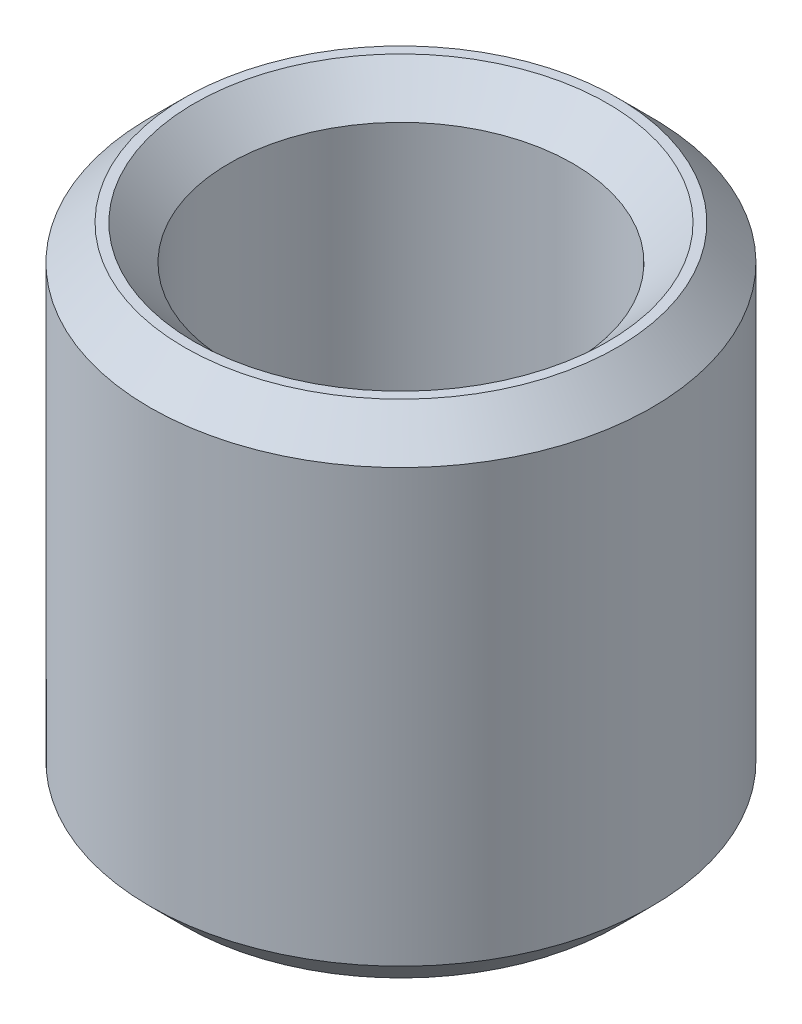
ISO-10303-21;
HEADER;
FILE_DESCRIPTION(('STEP AP214'),'2;1');
FILE_NAME('part.step','',(''),(''),'','','');
FILE_SCHEMA(('AUTOMOTIVE_DESIGN { 1 0 10303 214 1 1 1 1 }'));
ENDSEC;
DATA;
#1=APPLICATION_CONTEXT('core data for automotive mechanical design processes');
#2=APPLICATION_PROTOCOL_DEFINITION('international standard','automotive_design',2000,#1);
#3=PRODUCT_CONTEXT('',#1,'mechanical');
#4=PRODUCT('Part','Part','',(#3));
#5=PRODUCT_RELATED_PRODUCT_CATEGORY('part','',(#4));
#6=PRODUCT_DEFINITION_FORMATION('','',#4);
#7=PRODUCT_DEFINITION_CONTEXT('part definition',#1,'design');
#8=PRODUCT_DEFINITION('design','',#6,#7);
#9=PRODUCT_DEFINITION_SHAPE('','',#8);
#10=(LENGTH_UNIT() NAMED_UNIT(*) SI_UNIT(.MILLI.,.METRE.));
#11=(NAMED_UNIT(*) PLANE_ANGLE_UNIT() SI_UNIT($,.RADIAN.));
#12=(NAMED_UNIT(*) SI_UNIT($,.STERADIAN.) SOLID_ANGLE_UNIT());
#13=UNCERTAINTY_MEASURE_WITH_UNIT(LENGTH_MEASURE(1.E-05),#10,'distance_accuracy_value','');
#14=(GEOMETRIC_REPRESENTATION_CONTEXT(3) GLOBAL_UNCERTAINTY_ASSIGNED_CONTEXT((#13)) GLOBAL_UNIT_ASSIGNED_CONTEXT((#10,
#11,#12)) REPRESENTATION_CONTEXT('',''));
#15=CARTESIAN_POINT('',(0.,0.,0.));
#16=DIRECTION('',(0.,0.,1.));
#17=DIRECTION('',(1.,0.,0.));
#18=AXIS2_PLACEMENT_3D('',#15,#16,#17);
#19=CARTESIAN_POINT('',(0.,49.9193197108099,0.));
#20=DIRECTION('',(0.,-1.,0.));
#21=DIRECTION('',(0.,0.,-1.));
#22=AXIS2_PLACEMENT_3D('',#19,#20,#21);
#23=CYLINDRICAL_SURFACE('',#22,25.);
#24=CARTESIAN_POINT('',(0.,3.45639387999739,0.));
#25=DIRECTION('',(0.,1.,0.));
#26=DIRECTION('',(0.,0.,1.));
#27=AXIS2_PLACEMENT_3D('',#24,#25,#26);
#28=CIRCLE('',#27,25.);
#29=CARTESIAN_POINT('',(0.,3.45639387999739,25.));
#30=VERTEX_POINT('',#29);
#31=EDGE_CURVE('E10',#30,#30,#28,.T.);
#32=ORIENTED_EDGE('',*,*,#31,.T.);
#33=EDGE_LOOP('',(#32));
#34=FACE_BOUND('',#33,.T.);
#35=CARTESIAN_POINT('',(0.,46.4629258308125,0.));
#36=DIRECTION('',(0.,1.,0.));
#37=DIRECTION('',(0.,0.,1.));
#38=AXIS2_PLACEMENT_3D('',#35,#36,#37);
#39=CIRCLE('',#38,25.);
#40=CARTESIAN_POINT('',(0.,46.4629258308125,25.));
#41=VERTEX_POINT('',#40);
#42=EDGE_CURVE('E50',#41,#41,#39,.F.);
#43=ORIENTED_EDGE('',*,*,#42,.T.);
#44=EDGE_LOOP('',(#43));
#45=FACE_BOUND('',#44,.T.);
#46=ADVANCED_FACE('F39',(#34,#45),#23,.T.);
#47=CARTESIAN_POINT('',(0.,49.9193197108099,0.));
#48=DIRECTION('',(0.,1.,0.));
#49=DIRECTION('',(0.,0.,1.));
#50=AXIS2_PLACEMENT_3D('',#47,#48,#49);
#51=PLANE('',#50);
#52=CARTESIAN_POINT('',(0.,49.9193197108099,0.));
#53=DIRECTION('',(0.,1.,0.));
#54=DIRECTION('',(0.,0.,1.));
#55=AXIS2_PLACEMENT_3D('',#52,#53,#54);
#56=CIRCLE('',#55,20.5699607530416);
#57=CARTESIAN_POINT('',(0.,49.9193197108099,20.5699607530416));
#58=VERTEX_POINT('',#57);
#59=EDGE_CURVE('E58',#58,#58,#56,.F.);
#60=ORIENTED_EDGE('',*,*,#59,.T.);
#61=EDGE_LOOP('',(#60));
#62=FACE_BOUND('',#61,.T.);
#63=CARTESIAN_POINT('',(0.,49.9193197108099,0.));
#64=DIRECTION('',(0.,1.,0.));
#65=DIRECTION('',(0.,0.,1.));
#66=AXIS2_PLACEMENT_3D('',#63,#64,#65);
#67=CIRCLE('',#66,21.5436061200026);
#68=CARTESIAN_POINT('',(0.,49.9193197108099,21.5436061200026));
#69=VERTEX_POINT('',#68);
#70=EDGE_CURVE('E61',#69,#69,#67,.T.);
#71=ORIENTED_EDGE('',*,*,#70,.T.);
#72=EDGE_LOOP('',(#71));
#73=FACE_BOUND('',#72,.T.);
#74=ADVANCED_FACE('F88',(#62,#73),#51,.T.);
#75=CARTESIAN_POINT('',(0.,0.,0.));
#76=DIRECTION('',(0.,1.,0.));
#77=DIRECTION('',(0.,0.,1.));
#78=AXIS2_PLACEMENT_3D('',#75,#76,#77);
#79=PLANE('',#78);
#80=CARTESIAN_POINT('',(0.,0.,0.));
#81=DIRECTION('',(0.,1.,0.));
#82=DIRECTION('',(0.,0.,1.));
#83=AXIS2_PLACEMENT_3D('',#80,#81,#82);
#84=CIRCLE('',#83,20.5699607530416);
#85=CARTESIAN_POINT('',(0.,0.,20.5699607530416));
#86=VERTEX_POINT('',#85);
#87=EDGE_CURVE('E51',#86,#86,#84,.T.);
#88=ORIENTED_EDGE('',*,*,#87,.T.);
#89=EDGE_LOOP('',(#88));
#90=FACE_BOUND('',#89,.T.);
#91=CARTESIAN_POINT('',(0.,0.,0.));
#92=DIRECTION('',(0.,1.,0.));
#93=DIRECTION('',(0.,0.,1.));
#94=AXIS2_PLACEMENT_3D('',#91,#92,#93);
#95=CIRCLE('',#94,21.5436061200026);
#96=CARTESIAN_POINT('',(0.,0.,21.5436061200026));
#97=VERTEX_POINT('',#96);
#98=EDGE_CURVE('E54',#97,#97,#95,.F.);
#99=ORIENTED_EDGE('',*,*,#98,.T.);
#100=EDGE_LOOP('',(#99));
#101=FACE_BOUND('',#100,.T.);
#102=ADVANCED_FACE('F83',(#90,#101),#79,.F.);
#103=CARTESIAN_POINT('',(0.,49.9193197108099,0.));
#104=DIRECTION('',(0.,-1.,0.));
#105=DIRECTION('',(0.,0.,-1.));
#106=AXIS2_PLACEMENT_3D('',#103,#104,#105);
#107=CYLINDRICAL_SURFACE('',#106,17.1135668730442);
#108=CARTESIAN_POINT('',(0.,46.4629258308125,0.));
#109=DIRECTION('',(0.,1.,0.));
#110=DIRECTION('',(0.,0.,1.));
#111=AXIS2_PLACEMENT_3D('',#108,#109,#110);
#112=CIRCLE('',#111,17.1135668730442);
#113=CARTESIAN_POINT('',(0.,46.4629258308125,17.1135668730442));
#114=VERTEX_POINT('',#113);
#115=EDGE_CURVE('E67',#114,#114,#112,.T.);
#116=ORIENTED_EDGE('',*,*,#115,.T.);
#117=EDGE_LOOP('',(#116));
#118=FACE_BOUND('',#117,.T.);
#119=CARTESIAN_POINT('',(0.,3.45639387999739,0.));
#120=DIRECTION('',(0.,1.,0.));
#121=DIRECTION('',(0.,0.,1.));
#122=AXIS2_PLACEMENT_3D('',#119,#120,#121);
#123=CIRCLE('',#122,17.1135668730442);
#124=CARTESIAN_POINT('',(0.,3.45639387999739,17.1135668730442));
#125=VERTEX_POINT('',#124);
#126=EDGE_CURVE('E69',#125,#125,#123,.F.);
#127=ORIENTED_EDGE('',*,*,#126,.T.);
#128=EDGE_LOOP('',(#127));
#129=FACE_BOUND('',#128,.T.);
#130=ADVANCED_FACE('F71',(#118,#129),#107,.F.);
#131=CARTESIAN_POINT('',(0.,46.4629258308125,0.));
#132=DIRECTION('',(0.,1.,0.));
#133=DIRECTION('',(0.,0.,1.));
#134=AXIS2_PLACEMENT_3D('',#131,#132,#133);
#135=CONICAL_SURFACE('',#134,17.1135668730442,0.785398163397453);
#136=ORIENTED_EDGE('',*,*,#59,.F.);
#137=EDGE_LOOP('',(#136));
#138=FACE_BOUND('',#137,.T.);
#139=ORIENTED_EDGE('',*,*,#115,.F.);
#140=EDGE_LOOP('',(#139));
#141=FACE_BOUND('',#140,.T.);
#142=ADVANCED_FACE('F77',(#138,#141),#135,.F.);
#143=CARTESIAN_POINT('',(0.,0.,0.));
#144=DIRECTION('',(0.,-1.,0.));
#145=DIRECTION('',(0.,0.,-1.));
#146=AXIS2_PLACEMENT_3D('',#143,#144,#145);
#147=CONICAL_SURFACE('',#146,20.5699607530416,0.785398163397446);
#148=ORIENTED_EDGE('',*,*,#126,.F.);
#149=EDGE_LOOP('',(#148));
#150=FACE_BOUND('',#149,.T.);
#151=ORIENTED_EDGE('',*,*,#87,.F.);
#152=EDGE_LOOP('',(#151));
#153=FACE_BOUND('',#152,.T.);
#154=ADVANCED_FACE('F73',(#150,#153),#147,.F.);
#155=CARTESIAN_POINT('',(0.,3.45639387999739,0.));
#156=DIRECTION('',(0.,1.,0.));
#157=DIRECTION('',(0.,0.,1.));
#158=AXIS2_PLACEMENT_3D('',#155,#156,#157);
#159=CONICAL_SURFACE('',#158,25.,0.785398163397452);
#160=ORIENTED_EDGE('',*,*,#98,.F.);
#161=EDGE_LOOP('',(#160));
#162=FACE_BOUND('',#161,.T.);
#163=ORIENTED_EDGE('',*,*,#31,.F.);
#164=EDGE_LOOP('',(#163));
#165=FACE_BOUND('',#164,.T.);
#166=ADVANCED_FACE('F76',(#162,#165),#159,.T.);
#167=CARTESIAN_POINT('',(0.,49.9193197108099,0.));
#168=DIRECTION('',(0.,-1.,0.));
#169=DIRECTION('',(0.,0.,-1.));
#170=AXIS2_PLACEMENT_3D('',#167,#168,#169);
#171=CONICAL_SURFACE('',#170,21.5436061200026,0.785398163397446);
#172=ORIENTED_EDGE('',*,*,#42,.F.);
#173=EDGE_LOOP('',(#172));
#174=FACE_BOUND('',#173,.T.);
#175=ORIENTED_EDGE('',*,*,#70,.F.);
#176=EDGE_LOOP('',(#175));
#177=FACE_BOUND('',#176,.T.);
#178=ADVANCED_FACE('F45',(#174,#177),#171,.T.);
#179=CLOSED_SHELL('',(#46,#74,#102,#130,#142,#154,#166,#178));
#180=MANIFOLD_SOLID_BREP('B2',#179);
#181=ADVANCED_BREP_SHAPE_REPRESENTATION('',(#18,#180),#14);
#182=SHAPE_DEFINITION_REPRESENTATION(#9,#181);
ENDSEC;
END-ISO-10303-21;
